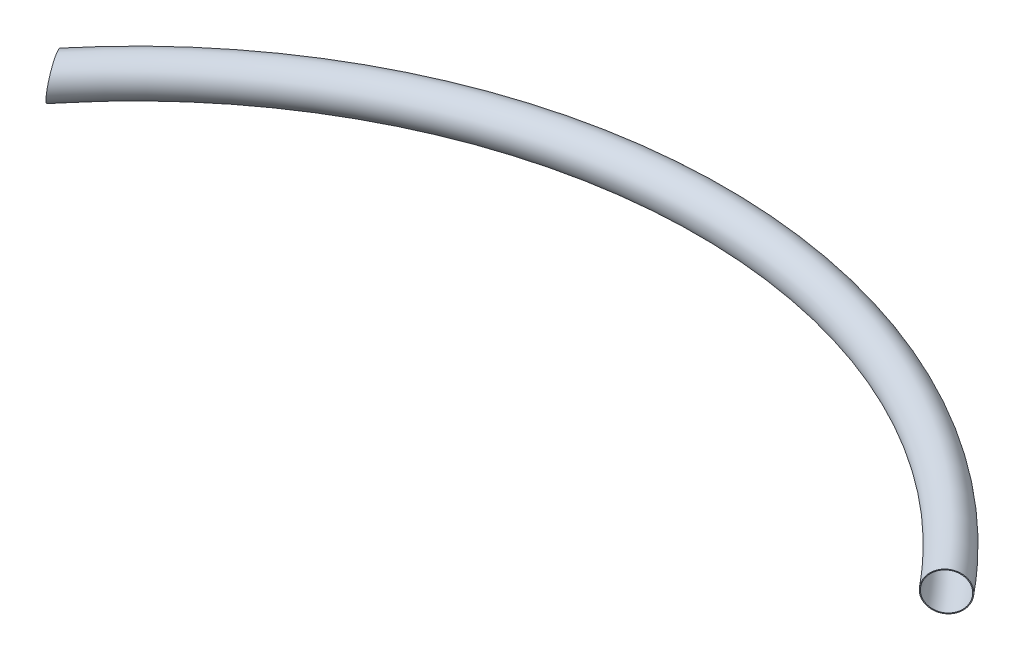
ISO-10303-21;
HEADER;
FILE_DESCRIPTION(('STEP AP214'),'2;1');
FILE_NAME('part.step','',(''),(''),'','','');
FILE_SCHEMA(('AUTOMOTIVE_DESIGN { 1 0 10303 214 1 1 1 1 }'));
ENDSEC;
DATA;
#1=APPLICATION_CONTEXT('core data for automotive mechanical design processes');
#2=APPLICATION_PROTOCOL_DEFINITION('international standard','automotive_design',2000,#1);
#3=PRODUCT_CONTEXT('',#1,'mechanical');
#4=PRODUCT('Part','Part','',(#3));
#5=PRODUCT_RELATED_PRODUCT_CATEGORY('part','',(#4));
#6=PRODUCT_DEFINITION_FORMATION('','',#4);
#7=PRODUCT_DEFINITION_CONTEXT('part definition',#1,'design');
#8=PRODUCT_DEFINITION('design','',#6,#7);
#9=PRODUCT_DEFINITION_SHAPE('','',#8);
#10=(LENGTH_UNIT() NAMED_UNIT(*) SI_UNIT(.MILLI.,.METRE.));
#11=(NAMED_UNIT(*) PLANE_ANGLE_UNIT() SI_UNIT($,.RADIAN.));
#12=(NAMED_UNIT(*) SI_UNIT($,.STERADIAN.) SOLID_ANGLE_UNIT());
#13=UNCERTAINTY_MEASURE_WITH_UNIT(LENGTH_MEASURE(1.E-05),#10,'distance_accuracy_value','');
#14=(GEOMETRIC_REPRESENTATION_CONTEXT(3) GLOBAL_UNCERTAINTY_ASSIGNED_CONTEXT((#13)) GLOBAL_UNIT_ASSIGNED_CONTEXT((#10,
#11,#12)) REPRESENTATION_CONTEXT('',''));
#15=CARTESIAN_POINT('',(0.,0.,0.));
#16=DIRECTION('',(0.,0.,1.));
#17=DIRECTION('',(1.,0.,0.));
#18=AXIS2_PLACEMENT_3D('',#15,#16,#17);
#19=CARTESIAN_POINT('',(0.,0.,1141.91160740362));
#20=DIRECTION('',(0.,-1.,0.));
#21=DIRECTION('',(0.,0.,-1.));
#22=AXIS2_PLACEMENT_3D('',#19,#20,#21);
#23=TOROIDAL_SURFACE('',#22,2500.81160740362,80.7338999999999);
#24=CARTESIAN_POINT('',(-1979.20686929793,-35.3852383598706,-502.780856281421));
#25=CARTESIAN_POINT('',(-1979.3991245248,-34.4097320346065,-503.293783131036));
#26=CARTESIAN_POINT('',(-1979.58008716303,-33.4234639280079,-503.790337505917));
#27=CARTESIAN_POINT('',(-1979.91897412592,-31.4308692296872,-504.749660949201));
#28=CARTESIAN_POINT('',(-1980.07690156036,-30.4245453663966,-505.212434573812));
#29=CARTESIAN_POINT('',(-1980.36933264064,-28.3931034040863,-506.103307878676));
#30=CARTESIAN_POINT('',(-1980.50383206896,-27.3679819577444,-506.531401308362));
#31=CARTESIAN_POINT('',(-1980.74898213253,-25.3006826151861,-507.351864955006));
#32=CARTESIAN_POINT('',(-1980.85963191885,-24.258504113247,-507.744233900069));
#33=CARTESIAN_POINT('',(-1981.05676831842,-22.1582614653444,-508.492495595245));
#34=CARTESIAN_POINT('',(-1981.14324238078,-21.100189367417,-508.848369338326));
#35=CARTESIAN_POINT('',(-1981.29164037947,-18.9703377150807,-509.522564850368));
#36=CARTESIAN_POINT('',(-1981.35356212045,-17.8985569437548,-509.840883259542));
#37=CARTESIAN_POINT('',(-1981.4525659267,-15.7433195508101,-510.439081929846));
#38=CARTESIAN_POINT('',(-1981.48965094582,-14.6598643332236,-510.718966758772));
#39=CARTESIAN_POINT('',(-1981.53877120841,-12.4829229907933,-511.239620734417));
#40=CARTESIAN_POINT('',(-1981.55080413865,-11.3894359490103,-511.480386267112));
#41=CARTESIAN_POINT('',(-1981.54963958368,-9.19268637284358,-511.922453337221));
#42=CARTESIAN_POINT('',(-1981.53640135289,-8.08941091123625,-512.123690564743));
#43=CARTESIAN_POINT('',(-1981.48449256695,-5.87671522718254,-512.485635600725));
#44=CARTESIAN_POINT('',(-1981.4458195946,-4.76729443064848,-512.646339555076));
#45=CARTESIAN_POINT('',(-1981.34298157329,-2.54453611819855,-512.92666960051));
#46=CARTESIAN_POINT('',(-1981.27881851067,-1.43119891417171,-513.046298891027));
#47=CARTESIAN_POINT('',(-1981.12499158504,0.797507777516382,-513.2440844216));
#48=CARTESIAN_POINT('',(-1981.03532525997,1.91287745105507,-513.322236655431));
#49=CARTESIAN_POINT('',(-1980.83058715901,4.14307701744492,-513.436704845798));
#50=CARTESIAN_POINT('',(-1980.715523482,5.25790696908307,-513.473034116209));
#51=CARTESIAN_POINT('',(-1980.46008741844,7.48535285808889,-513.503676897148));
#52=CARTESIAN_POINT('',(-1980.31971249135,8.59796856186193,-513.497986187721));
#53=CARTESIAN_POINT('',(-1980.01386331799,10.8186100605355,-513.444452735829));
#54=CARTESIAN_POINT('',(-1979.84839218149,11.9266364066669,-513.396615212387));
#55=CARTESIAN_POINT('',(-1979.49259951448,14.136086708019,-513.258790241673));
#56=CARTESIAN_POINT('',(-1979.30227564159,15.2375100306536,-513.168798819299));
#57=CARTESIAN_POINT('',(-1978.70717079521,18.4598326055181,-512.842624740277));
#58=CARTESIAN_POINT('',(-1978.26853304244,20.5690309131438,-512.548469165553));
#59=CARTESIAN_POINT('',(-1977.30217837921,24.7385461549989,-511.803970653447));
#60=CARTESIAN_POINT('',(-1976.77446332982,26.7988641094489,-511.353630978977));
#61=CARTESIAN_POINT('',(-1975.63384164525,30.8557352386496,-510.300141360386));
#62=CARTESIAN_POINT('',(-1975.02094243889,32.8522939551197,-509.697004737744));
#63=CARTESIAN_POINT('',(-1973.71464122692,36.7673088691517,-508.342724554317));
#64=CARTESIAN_POINT('',(-1973.02123946605,38.685765304125,-507.591581443474));
#65=CARTESIAN_POINT('',(-1971.57000943179,42.4038122410931,-505.959454185326));
#66=CARTESIAN_POINT('',(-1970.81326552163,44.2047262215228,-505.080518535497));
#67=CARTESIAN_POINT('',(-1969.23265760134,47.7057112443548,-503.192024700909));
#68=CARTESIAN_POINT('',(-1968.40879458239,49.4057837752954,-502.182468444964));
#69=CARTESIAN_POINT('',(-1966.70014661937,52.6944525477765,-500.040764509439));
#70=CARTESIAN_POINT('',(-1965.81536007325,54.2830458556495,-498.908613605673));
#71=CARTESIAN_POINT('',(-1963.99143946698,57.3392969371135,-496.530606730909));
#72=CARTESIAN_POINT('',(-1963.05230429106,58.8069522263533,-495.284748425202));
#73=CARTESIAN_POINT('',(-1961.10499502209,61.6444780953998,-492.659875808818));
#74=CARTESIAN_POINT('',(-1960.09574843969,63.0114385623153,-491.278511832024));
#75=CARTESIAN_POINT('',(-1958.03493708867,65.6031536085334,-488.417537480918));
#76=CARTESIAN_POINT('',(-1956.98337192124,66.8279068472306,-486.937926180623));
#77=CARTESIAN_POINT('',(-1954.84517020738,69.1294613242307,-483.891198368159));
#78=CARTESIAN_POINT('',(-1953.7585288182,70.2062420240798,-482.324069751034));
#79=CARTESIAN_POINT('',(-1951.55763331375,72.2070590909239,-479.113589202808));
#80=CARTESIAN_POINT('',(-1950.44337839745,73.1310910208972,-477.470235059294));
#81=CARTESIAN_POINT('',(-1948.13815927148,74.8653294362464,-474.034530603023));
#82=CARTESIAN_POINT('',(-1946.94614646326,75.6675272768953,-472.238839411558));
#83=CARTESIAN_POINT('',(-1944.547731136,77.0970553839469,-468.588480581178));
#84=CARTESIAN_POINT('',(-1943.34132820753,77.7243806624434,-466.733811261704));
#85=CARTESIAN_POINT('',(-1940.92175009196,78.802782977862,-462.977728416542));
#86=CARTESIAN_POINT('',(-1939.70857358884,79.2538244642697,-461.076305544326));
#87=CARTESIAN_POINT('',(-1937.28325281461,79.9790415127317,-457.239409241176));
#88=CARTESIAN_POINT('',(-1936.07110857424,80.253211979053,-455.303934830851));
#89=CARTESIAN_POINT('',(-1933.5832744689,80.6361808602752,-451.295192547975));
#90=CARTESIAN_POINT('',(-1932.30809119031,80.7341781945253,-449.220573737698));
#91=CARTESIAN_POINT('',(-1929.77538238225,80.7336205870288,-445.060613378186));
#92=CARTESIAN_POINT('',(-1928.51785750743,80.6350583775755,-442.975271435312));
#93=CARTESIAN_POINT('',(-1926.02822139539,80.2436950901279,-438.807071027152));
#94=CARTESIAN_POINT('',(-1924.7961155865,79.9508529568476,-436.724213180025));
#95=CARTESIAN_POINT('',(-1922.36530580337,79.1740204650871,-432.57472582036));
#96=CARTESIAN_POINT('',(-1921.16660249877,78.6900262774274,-430.508096633761));
#97=CARTESIAN_POINT('',(-1918.75570341682,77.5080443416732,-426.309427822483));
#98=CARTESIAN_POINT('',(-1917.54543333223,76.8012197314871,-424.178765054919));
#99=CARTESIAN_POINT('',(-1915.17790837901,75.1876982227604,-419.964118653642));
#100=CARTESIAN_POINT('',(-1914.02065529094,74.2809946172786,-417.880136588884));
#101=CARTESIAN_POINT('',(-1911.767103255,72.2735066983154,-413.773061401992));
#102=CARTESIAN_POINT('',(-1910.67081324538,71.172694023188,-411.749977228405));
#103=CARTESIAN_POINT('',(-1908.54734944141,68.7839606221137,-407.779512851352));
#104=CARTESIAN_POINT('',(-1907.52017550308,67.4960402859468,-405.832132490193));
#105=CARTESIAN_POINT('',(-1905.53111871811,64.724547534705,-402.005066350618));
#106=CARTESIAN_POINT('',(-1904.57012747232,63.238886290534,-400.126422813802));
#107=CARTESIAN_POINT('',(-1903.19377060545,60.8798779421932,-397.389051908668));
#108=CARTESIAN_POINT('',(-1902.74577686396,60.0716563517338,-396.489896844471));
#109=CARTESIAN_POINT('',(-1901.87240942962,58.4128565547507,-394.720178421511));
#110=CARTESIAN_POINT('',(-1901.44703342148,57.5622827009974,-393.849612139725));
#111=CARTESIAN_POINT('',(-1900.61983190796,55.8200388420599,-392.138854255442));
#112=CARTESIAN_POINT('',(-1900.21800783735,54.9283663390361,-391.298664504683));
#113=CARTESIAN_POINT('',(-1899.43891397681,53.1054675284857,-389.650620057562));
#114=CARTESIAN_POINT('',(-1899.0616416026,52.1742454009921,-388.842761961484));
#115=CARTESIAN_POINT('',(-1898.33250971175,50.2735987282998,-387.261064118955));
#116=CARTESIAN_POINT('',(-1897.98065220301,49.3041711740293,-386.487227062207));
#117=CARTESIAN_POINT('',(-1897.30333029898,47.3288984382168,-384.97554203937));
#118=CARTESIAN_POINT('',(-1896.97786293388,46.3230573729528,-384.237690027435));
#119=CARTESIAN_POINT('',(-1896.36427755386,44.3097517455021,-382.82300232389));
#120=CARTESIAN_POINT('',(-1896.07529082022,43.3033967550287,-382.144964058068));
#121=CARTESIAN_POINT('',(-1895.52362731844,41.2598693025282,-380.825871884782));
#122=CARTESIAN_POINT('',(-1895.26094760298,40.2227003096928,-380.184813837629));
#123=CARTESIAN_POINT('',(-1894.76258654337,38.119080354742,-378.941123110482));
#124=CARTESIAN_POINT('',(-1894.52690813079,37.0526262286417,-378.338494605994));
#125=CARTESIAN_POINT('',(-1894.0833247529,34.8925213135489,-377.17335744398));
#126=CARTESIAN_POINT('',(-1893.87541678151,33.7988734834169,-376.610844447153));
#127=CARTESIAN_POINT('',(-1893.48806051126,31.5864488498346,-375.527483286934));
#128=CARTESIAN_POINT('',(-1893.30860686449,30.4676768136247,-375.006627303391));
#129=CARTESIAN_POINT('',(-1892.97876517007,28.2070086670862,-374.007980579284));
#130=CARTESIAN_POINT('',(-1892.82837395298,27.065115093331,-373.530185145729));
#131=CARTESIAN_POINT('',(-1892.55721619487,24.7602715033136,-372.61899566165));
#132=CARTESIAN_POINT('',(-1892.43644989559,23.5973213153169,-372.185601973452));
#133=CARTESIAN_POINT('',(-1892.22507230736,21.2526888629364,-371.364556799671));
#134=CARTESIAN_POINT('',(-1892.13446055547,20.0710068864205,-370.97690461191));
#135=CARTESIAN_POINT('',(-1891.988678112,17.7675641181712,-370.271920934093));
#136=CARTESIAN_POINT('',(-1891.93160887285,16.646814159375,-369.951675471567));
#137=CARTESIAN_POINT('',(-1891.84460821734,14.3929847492145,-369.353265180202));
#138=CARTESIAN_POINT('',(-1891.8146789817,13.2599043144857,-369.075103734352));
#139=CARTESIAN_POINT('',(-1891.78223269777,10.9837348268435,-368.561781172809));
#140=CARTESIAN_POINT('',(-1891.77971373032,9.84064648025679,-368.326617047732));
#141=CARTESIAN_POINT('',(-1891.80228340571,7.54660657875503,-367.900043703805));
#142=CARTESIAN_POINT('',(-1891.82737187913,6.3956550721418,-367.708634216427));
#143=CARTESIAN_POINT('',(-1891.90527696413,4.08850408874175,-367.370296668432));
#144=CARTESIAN_POINT('',(-1891.9580854991,2.93230623777458,-367.223355670958));
#145=CARTESIAN_POINT('',(-1892.0914787363,0.616787702436909,-366.974463494447));
#146=CARTESIAN_POINT('',(-1892.17206064849,-0.542532656651809,-366.872507798646));
#147=CARTESIAN_POINT('',(-1892.3609862143,-2.86203597223574,-366.714019342639));
#148=CARTESIAN_POINT('',(-1892.4693302846,-4.02221894141743,-366.65748726426));
#149=CARTESIAN_POINT('',(-1892.71368341229,-6.34099103230734,-366.590183595107));
#150=CARTESIAN_POINT('',(-1892.84969208349,-7.49958017603699,-366.579411365604));
#151=CARTESIAN_POINT('',(-1893.13980422272,-9.74017626812419,-366.603064550224));
#152=CARTESIAN_POINT('',(-1893.29223838423,-10.8224300270853,-366.634698329509));
#153=CARTESIAN_POINT('',(-1893.62105748527,-12.981448510955,-366.738413219747));
#154=CARTESIAN_POINT('',(-1893.79744446845,-14.0582127593602,-366.810497783581));
#155=CARTESIAN_POINT('',(-1894.1738571996,-16.2039673751842,-366.995063561691));
#156=CARTESIAN_POINT('',(-1894.3738797116,-17.2729587855654,-367.107539250267));
#157=CARTESIAN_POINT('',(-1894.79726430162,-19.401392672971,-367.372754610397));
#158=CARTESIAN_POINT('',(-1895.0206286545,-20.4608342083252,-367.52549820863));
#159=CARTESIAN_POINT('',(-1895.49021311669,-22.5677563295881,-367.870942241803));
#160=CARTESIAN_POINT('',(-1895.73642684442,-23.6152401639136,-368.063631538802));
#161=CARTESIAN_POINT('',(-1896.25132559811,-25.6966689032516,-368.488654437833));
#162=CARTESIAN_POINT('',(-1896.5200128768,-26.730612438944,-368.720992016634));
#163=CARTESIAN_POINT('',(-1897.07928555813,-28.7827984087923,-369.224807060611));
#164=CARTESIAN_POINT('',(-1897.36986864314,-29.8010424909919,-369.496280386133));
#165=CARTESIAN_POINT('',(-1897.97240897862,-31.8201400587458,-370.077847807732));
#166=CARTESIAN_POINT('',(-1898.28436823432,-32.8209919017264,-370.387945529264));
#167=CARTESIAN_POINT('',(-1898.91970585018,-34.7747646983948,-371.036583478037));
#168=CARTESIAN_POINT('',(-1899.24249526736,-35.7282354763953,-371.374045272173));
#169=CARTESIAN_POINT('',(-1899.90702097686,-37.6153955537379,-372.084086143378));
#170=CARTESIAN_POINT('',(-1900.24875898371,-38.5490830524207,-372.456668400412));
#171=CARTESIAN_POINT('',(-1900.95045952312,-40.3949220879161,-373.236118368949));
#172=CARTESIAN_POINT('',(-1901.31041984548,-41.3070762169387,-373.642981926411));
#173=CARTESIAN_POINT('',(-1902.0479041242,-43.1084821659628,-374.490185163368));
#174=CARTESIAN_POINT('',(-1902.42542970494,-43.9977318559703,-374.930527941316));
#175=CARTESIAN_POINT('',(-1903.58321019777,-46.6287743507846,-376.300370854118));
#176=CARTESIAN_POINT('',(-1904.38885074788,-48.3343386360893,-377.278887690211));
#177=CARTESIAN_POINT('',(-1906.06122218913,-51.6372039445149,-379.358140023528));
#178=CARTESIAN_POINT('',(-1906.9279543328,-53.2345027466373,-380.458878026822));
#179=CARTESIAN_POINT('',(-1908.73101837575,-56.3374965250335,-382.793181984022));
#180=CARTESIAN_POINT('',(-1909.66826786064,-57.8412269450002,-384.028652078185));
#181=CARTESIAN_POINT('',(-1911.59227189124,-60.7191531266928,-386.607081794681));
#182=CARTESIAN_POINT('',(-1912.57902667865,-62.0933482559313,-387.950041941801));
#183=CARTESIAN_POINT('',(-1914.59509278732,-64.705475490302,-390.733399009756));
#184=CARTESIAN_POINT('',(-1915.62441004461,-65.9433884999332,-392.173809539552));
#185=CARTESIAN_POINT('',(-1917.71838962146,-68.2771004154219,-395.141405438825));
#186=CARTESIAN_POINT('',(-1918.78305303397,-69.3728949216278,-396.668593492624));
#187=CARTESIAN_POINT('',(-1920.99605488155,-71.4703446480974,-399.879427909192));
#188=CARTESIAN_POINT('',(-1922.14588495556,-72.4642946170999,-401.567081504281));
#189=CARTESIAN_POINT('',(-1924.4688987967,-74.2863091605275,-405.014272668116));
#190=CARTESIAN_POINT('',(-1925.6420832338,-75.1143689685287,-406.773812300572));
#191=CARTESIAN_POINT('',(-1928.0043086435,-76.6020583027345,-410.352976173424));
#192=CARTESIAN_POINT('',(-1929.19335291969,-77.261652142358,-412.172613052336));
#193=CARTESIAN_POINT('',(-1931.57957099481,-78.4105334577448,-415.859659356187));
#194=CARTESIAN_POINT('',(-1932.77674503969,-78.8998157574237,-417.727070231217));
#195=CARTESIAN_POINT('',(-1935.24773954448,-79.7328325930582,-421.617196197888));
#196=CARTESIAN_POINT('',(-1936.52162121262,-80.0654112984727,-423.642266499163));
#197=CARTESIAN_POINT('',(-1939.06201166785,-80.5372204949395,-427.719374657352));
#198=CARTESIAN_POINT('',(-1940.32852016515,-80.6764434366871,-429.77141356406));
#199=CARTESIAN_POINT('',(-1942.84627640487,-80.7624864415937,-433.889312434943));
#200=CARTESIAN_POINT('',(-1944.09752137258,-80.7092720301052,-435.955174809383));
#201=CARTESIAN_POINT('',(-1946.57670524519,-80.412088640569,-440.087173463052));
#202=CARTESIAN_POINT('',(-1947.80464367754,-80.1681157990095,-442.15330974698));
#203=CARTESIAN_POINT('',(-1950.28953898218,-79.4751596662172,-446.374677823235));
#204=CARTESIAN_POINT('',(-1951.54493050964,-79.0166398439304,-448.529266020334));
#205=CARTESIAN_POINT('',(-1954.01329740804,-77.8957187639052,-452.809981985326));
#206=CARTESIAN_POINT('',(-1955.22627114525,-77.2333096629451,-454.936108655074));
#207=CARTESIAN_POINT('',(-1957.00747426798,-76.0903017880499,-458.092656363928));
#208=CARTESIAN_POINT('',(-1957.59501605979,-75.6842447472827,-459.139731614283));
#209=CARTESIAN_POINT('',(-1958.75631326806,-74.8229397773315,-461.221180534931));
#210=CARTESIAN_POINT('',(-1959.33006993526,-74.3676963317047,-462.255555353368));
#211=CARTESIAN_POINT('',(-1960.46282824634,-73.4086699017893,-464.309880811555));
#212=CARTESIAN_POINT('',(-1961.02182871085,-72.9048830526633,-465.32983029539));
#213=CARTESIAN_POINT('',(-1962.12398089256,-71.8495968480079,-467.353341547854));
#214=CARTESIAN_POINT('',(-1962.66713405918,-71.2981018743759,-468.356904811481));
#215=CARTESIAN_POINT('',(-1963.74525501288,-70.1389147113156,-470.361945146491));
#216=CARTESIAN_POINT('',(-1964.279950203,-69.5304606673519,-471.363128467571));
#217=CARTESIAN_POINT('',(-1965.33090976126,-68.2660724248425,-473.344819505891));
#218=CARTESIAN_POINT('',(-1965.84717587541,-67.610142742136,-474.325329178162));
#219=CARTESIAN_POINT('',(-1966.86039506002,-66.2516205254088,-476.264058730539));
#220=CARTESIAN_POINT('',(-1967.35734461989,-65.5490195716452,-477.222274546385));
#221=CARTESIAN_POINT('',(-1968.33076523102,-64.098402375491,-479.114250026108));
#222=CARTESIAN_POINT('',(-1968.80723834263,-63.3503907207314,-480.048012146831));
#223=CARTESIAN_POINT('',(-1969.73829261827,-61.8107982163294,-481.888385623848));
#224=CARTESIAN_POINT('',(-1970.19289501851,-61.0192612982221,-482.795022980671));
#225=CARTESIAN_POINT('',(-1971.07967786072,-59.3932557825328,-484.580147567102));
#226=CARTESIAN_POINT('',(-1971.51186053731,-58.5587914802006,-485.458637598871));
#227=CARTESIAN_POINT('',(-1972.35280656927,-56.8483186526513,-487.185549000865));
#228=CARTESIAN_POINT('',(-1972.76157425666,-55.9723178672944,-488.033975921932));
#229=CARTESIAN_POINT('',(-1973.55478177764,-54.1801436681172,-489.698991673488));
#230=CARTESIAN_POINT('',(-1973.93922291366,-53.2639724094634,-490.515582207586));
#231=CARTESIAN_POINT('',(-1974.81937574526,-51.0494156313781,-492.40876801837));
#232=CARTESIAN_POINT('',(-1975.3041594069,-49.7341290708431,-493.470830374279));
#233=CARTESIAN_POINT('',(-1975.99410279998,-47.7104219173547,-495.013034526311));
#234=CARTESIAN_POINT('',(-1976.21786273529,-47.0274446945231,-495.518583929317));
#235=CARTESIAN_POINT('',(-1976.65278508178,-45.6448897641293,-496.512347015614));
#236=CARTESIAN_POINT('',(-1976.86394560391,-44.9453095891297,-497.000558094924));
#237=CARTESIAN_POINT('',(-1977.47801500378,-42.8228191054169,-498.438107866587));
#238=CARTESIAN_POINT('',(-1977.86159980472,-41.3759006505432,-499.36055995727));
#239=CARTESIAN_POINT('',(-1978.57503479884,-38.4232531185606,-501.129093804354));
#240=CARTESIAN_POINT('',(-1978.90488302623,-36.9175218924635,-501.975172766374));
#241=CARTESIAN_POINT('',(-1979.20686929793,-35.3852383598706,-502.780856281421));
#242=B_SPLINE_CURVE_WITH_KNOTS('',3,(#24,#25,#26,#27,#28,#29,#30,#31,#32,#33,#34,#35,#36,#37,
#38,#39,#40,#41,#42,#43,#44,#45,#46,#47,#48,#49,#50,#51,#52,#53,#54,#55,#56,#57,#58,#59,#60,#61,
#62,#63,#64,#65,#66,#67,#68,#69,#70,#71,#72,#73,#74,#75,#76,#77,#78,#79,#80,#81,#82,#83,#84,#85,
#86,#87,#88,#89,#90,#91,#92,#93,#94,#95,#96,#97,#98,#99,#100,#101,#102,#103,#104,#105,#106,#107,
#108,#109,#110,#111,#112,#113,#114,#115,#116,#117,#118,#119,#120,#121,#122,#123,#124,#125,#126,
#127,#128,#129,#130,#131,#132,#133,#134,#135,#136,#137,#138,#139,#140,#141,#142,#143,#144,#145,
#146,#147,#148,#149,#150,#151,#152,#153,#154,#155,#156,#157,#158,#159,#160,#161,#162,#163,#164,
#165,#166,#167,#168,#169,#170,#171,#172,#173,#174,#175,#176,#177,#178,#179,#180,#181,#182,#183,
#184,#185,#186,#187,#188,#189,#190,#191,#192,#193,#194,#195,#196,#197,#198,#199,#200,#201,#202,
#203,#204,#205,#206,#207,#208,#209,#210,#211,#212,#213,#214,#215,#216,#217,#218,#219,#220,#221,
#222,#223,#224,#225,#226,#227,#228,#229,#230,#231,#232,#233,#234,#235,#236,#237,#238,#239,#240,
#241),.UNSPECIFIED.,.T.,.F.,(4,2,2,2,2,2,2,2,2,2,2,2,2,2,2,2,2,2,2,2,2,2,2,2,2,2,2,2,2,2,2,2,2,
2,2,2,2,2,2,2,2,2,2,2,2,2,2,2,2,2,2,2,2,2,2,2,2,2,2,2,2,2,2,2,2,2,2,2,2,2,2,2,2,2,2,2,2,2,2,2,2,
2,2,2,2,2,2,2,2,2,2,2,2,2,2,2,2,2,2,2,2,2,2,2,2,2,2,2,4),(0.,3.35599820151084,6.7115429203625,
10.0676910847131,13.4239586908442,16.7819654877918,20.1402724724121,23.4981799793417,
26.856397529313,30.2200342251254,33.5839906321782,36.9476849506978,40.3117041058627,
43.67465206651,47.037937763616,50.4008070449816,53.7639935078934,60.2782743286442,
66.7924190648425,73.305996065875,79.819553265775,86.2383256914214,92.6570033448485,
99.075849847772,105.49482817604,112.05693649182,118.619106664397,125.182186742247,
131.745457429901,138.637123706034,145.528986533692,152.422238502123,159.315689059349,
166.618980003533,173.922540988845,181.227645856458,188.532897068181,196.17493538131,
203.817230162137,211.460642499879,219.104038915207,226.835756153953,230.702790108578,
234.569427444313,238.436300092121,242.302765059042,246.169535160968,250.03586950974,
253.776872208512,257.517455311077,261.258444151169,264.999027712115,268.738907407805,
272.47837901533,276.217881135164,279.957325842385,283.457216199552,286.957387751479,
290.457314232411,293.957219233283,297.456105054131,300.954639488122,304.453226435512,
307.951764548407,311.230937033447,314.510389471367,317.789393435279,321.068717265796,
324.347127958937,327.62586767402,330.904260828636,334.182961939726,337.367089117345,
340.551504877564,343.735535319199,346.919860797849,353.286866925317,359.654003628417,
366.127001207477,372.600030390875,379.073965407237,385.548100793452,392.354112130252,
399.160318992106,405.967966436772,412.775820760445,420.01402670011,427.252515237435,
434.492300595243,441.732232587307,449.329993171486,456.92804606318,460.729530070552,
464.530667847819,468.332108507385,472.133200382074,475.995493037248,479.857418796278,
483.720043169213,487.582277966534,491.44068358704,495.298703889335,499.156008096296,
503.013105609523,508.285404356072,510.921146589805,513.557283016426,518.828548387786,
524.100006548957),.UNSPECIFIED.);
#243=CARTESIAN_POINT('',(-1979.20686929793,-35.3852383598706,-502.780856281421));
#244=VERTEX_POINT('',#243);
#245=EDGE_CURVE('E49',#244,#244,#242,.T.);
#246=ORIENTED_EDGE('',*,*,#245,.F.);
#247=EDGE_LOOP('',(#246));
#248=FACE_BOUND('',#247,.T.);
#249=CARTESIAN_POINT('',(1936.74818533626,0.,-440.196215192991));
#250=DIRECTION('',(-0.632637747646725,0.,-0.77444785508934));
#251=DIRECTION('',(-0.77444785508934,0.,0.632637747646725));
#252=AXIS2_PLACEMENT_3D('',#249,#250,#251);
#253=CIRCLE('',#252,80.7338999999999);
#254=CARTESIAN_POINT('',(1874.22398964826,0.,-389.120902538255));
#255=VERTEX_POINT('',#254);
#256=EDGE_CURVE('E53',#255,#255,#253,.T.);
#257=ORIENTED_EDGE('',*,*,#256,.F.);
#258=EDGE_LOOP('',(#257));
#259=FACE_BOUND('',#258,.T.);
#260=ADVANCED_FACE('F38',(#248,#259),#23,.F.);
#261=CARTESIAN_POINT('',(559.47382164096,0.,684.883731266744));
#262=DIRECTION('',(-0.632637747646725,0.,-0.77444785508934));
#263=DIRECTION('',(-0.77444785508934,0.,0.632637747646725));
#264=AXIS2_PLACEMENT_3D('',#261,#262,#263);
#265=PLANE('',#264);
#266=ORIENTED_EDGE('',*,*,#256,.T.);
#267=EDGE_LOOP('',(#266));
#268=FACE_BOUND('',#267,.T.);
#269=CARTESIAN_POINT('',(1936.74818533626,0.,-440.196215192991));
#270=DIRECTION('',(-0.632637747646725,0.,-0.77444785508934));
#271=DIRECTION('',(-0.77444785508934,0.,0.632637747646725));
#272=AXIS2_PLACEMENT_3D('',#269,#270,#271);
#273=CIRCLE('',#272,84.1374999999999);
#274=CARTESIAN_POINT('',(1871.58807892868,0.,-386.967656700365));
#275=VERTEX_POINT('',#274);
#276=EDGE_CURVE('E58',#275,#275,#273,.T.);
#277=ORIENTED_EDGE('',*,*,#276,.F.);
#278=EDGE_LOOP('',(#277));
#279=FACE_BOUND('',#278,.T.);
#280=ADVANCED_FACE('F67',(#268,#279),#265,.F.);
#281=CARTESIAN_POINT('',(0.,0.,1141.91160740362));
#282=DIRECTION('',(0.,-1.,0.));
#283=DIRECTION('',(0.,0.,-1.));
#284=AXIS2_PLACEMENT_3D('',#281,#282,#283);
#285=TOROIDAL_SURFACE('',#284,2500.81160740362,84.1374999999999);
#286=CARTESIAN_POINT('',(-1980.7480870676,-38.0946259409135,-504.764641624163));
#287=CARTESIAN_POINT('',(-1980.9583149747,-37.0845888247402,-505.314066638411));
#288=CARTESIAN_POINT('',(-1981.15681522281,-36.0629811665172,-505.846568053307));
#289=CARTESIAN_POINT('',(-1981.52987251687,-33.9981352438934,-506.876617079955));
#290=CARTESIAN_POINT('',(-1981.70443278929,-32.9548999161742,-507.374169397477));
#291=CARTESIAN_POINT('',(-1982.02919459607,-30.8481015528841,-508.333374406735));
#292=CARTESIAN_POINT('',(-1982.17939173785,-29.7845348902166,-508.795020616963));
#293=CARTESIAN_POINT('',(-1982.45496546536,-27.6388690179536,-509.68129208297));
#294=CARTESIAN_POINT('',(-1982.58034116888,-26.5567691511437,-510.105916022618));
#295=CARTESIAN_POINT('',(-1982.80593116805,-24.3752409337618,-510.917339765066));
#296=CARTESIAN_POINT('',(-1982.9061323103,-23.2758038421974,-511.30411973069));
#297=CARTESIAN_POINT('',(-1983.08094573058,-21.0618593834994,-512.038697048377));
#298=CARTESIAN_POINT('',(-1983.15555572151,-19.9473506786525,-512.386490914356));
#299=CARTESIAN_POINT('',(-1983.27886275334,-17.7053683018973,-513.042138239132));
#300=CARTESIAN_POINT('',(-1983.32756287501,-16.5778961876758,-513.349996443119));
#301=CARTESIAN_POINT('',(-1983.39881230069,-14.3116925421488,-513.925037053603));
#302=CARTESIAN_POINT('',(-1983.4213591902,-13.1729599810516,-514.192215702538));
#303=CARTESIAN_POINT('',(-1983.44010764792,-10.8844520206058,-514.685533968172));
#304=CARTESIAN_POINT('',(-1983.43626565382,-9.73466149218562,-514.911605093647));
#305=CARTESIAN_POINT('',(-1983.40198569375,-7.42785558063671,-515.321524987839));
#306=CARTESIAN_POINT('',(-1983.37154519925,-6.27083952100893,-515.505369740288));
#307=CARTESIAN_POINT('',(-1983.28398125152,-3.95190245457163,-515.830225145894));
#308=CARTESIAN_POINT('',(-1983.22685986859,-2.78998183525966,-515.971239121081));
#309=CARTESIAN_POINT('',(-1983.08590328033,-0.463200281571591,-516.209985213062));
#310=CARTESIAN_POINT('',(-1983.0020654943,0.701660926065804,-516.307713146405));
#311=CARTESIAN_POINT('',(-1982.80774392345,3.03168986444723,-516.459466242152));
#312=CARTESIAN_POINT('',(-1982.69726739502,4.1968574255482,-516.513503288549));
#313=CARTESIAN_POINT('',(-1982.44976222194,6.52558512507905,-516.577641984851));
#314=CARTESIAN_POINT('',(-1982.31273354239,7.68914526139481,-516.587743577025));
#315=CARTESIAN_POINT('',(-1982.01230226694,10.0123699430484,-516.563841593038));
#316=CARTESIAN_POINT('',(-1981.8489004071,11.1720345961858,-516.529839247613));
#317=CARTESIAN_POINT('',(-1981.49596183552,13.4852394008656,-516.417671560102));
#318=CARTESIAN_POINT('',(-1981.30642512212,14.6387795520159,-516.339506215188));
#319=CARTESIAN_POINT('',(-1980.90803171202,16.9005471557699,-516.14228537726));
#320=CARTESIAN_POINT('',(-1980.6999909454,18.0090401083173,-516.024623668169));
#321=CARTESIAN_POINT('',(-1980.26004472095,20.2162082910844,-515.748119450834));
#322=CARTESIAN_POINT('',(-1980.02813721186,21.3148826685909,-515.589273401128));
#323=CARTESIAN_POINT('',(-1979.54089459399,23.5001844219729,-515.230667849249));
#324=CARTESIAN_POINT('',(-1979.28556210474,24.586813129669,-515.030912918669));
#325=CARTESIAN_POINT('',(-1978.75191408556,26.7461553118932,-514.590842187204));
#326=CARTESIAN_POINT('',(-1978.47359634945,27.8188674392013,-514.350522490461));
#327=CARTESIAN_POINT('',(-1977.60501658499,31.0127316560659,-513.569427872959));
#328=CARTESIAN_POINT('',(-1976.98094613488,33.110427006248,-512.968383523395));
#329=CARTESIAN_POINT('',(-1975.64775659383,37.22653123599,-511.61058228279));
#330=CARTESIAN_POINT('',(-1974.9386378697,39.2449404574627,-510.853826063327));
#331=CARTESIAN_POINT('',(-1973.45297825977,43.1565095327622,-509.204262243217));
#332=CARTESIAN_POINT('',(-1972.67771757725,45.0511699475706,-508.313860587268));
#333=CARTESIAN_POINT('',(-1971.05612382025,48.737547595244,-506.395518823073));
#334=CARTESIAN_POINT('',(-1970.20979187354,50.5292664608518,-505.367580897135));
#335=CARTESIAN_POINT('',(-1968.4524339453,53.9984609146227,-503.182358890593));
#336=CARTESIAN_POINT('',(-1967.54140667491,55.6759342254954,-502.025072232858));
#337=CARTESIAN_POINT('',(-1965.66144871266,58.9065363341078,-499.590264469329));
#338=CARTESIAN_POINT('',(-1964.69251687363,60.4596626669229,-498.312740981177));
#339=CARTESIAN_POINT('',(-1962.68328060856,63.4634870254525,-495.619766557317));
#340=CARTESIAN_POINT('',(-1961.64191657362,64.9114132457373,-494.202015063997));
#341=CARTESIAN_POINT('',(-1959.5138484834,67.6607942921557,-491.262440376973));
#342=CARTESIAN_POINT('',(-1958.42714405222,68.9622479035985,-489.740616320367));
#343=CARTESIAN_POINT('',(-1956.215918443,71.4124664212245,-486.603996541679));
#344=CARTESIAN_POINT('',(-1955.09139221021,72.5612108159756,-484.98918837192));
#345=CARTESIAN_POINT('',(-1952.8122713628,74.7008009364922,-481.678273696016));
#346=CARTESIAN_POINT('',(-1951.65767588268,75.6916421114491,-479.982164848599));
#347=CARTESIAN_POINT('',(-1949.26877857408,77.5562370948482,-476.435369212236));
#348=CARTESIAN_POINT('',(-1948.03334256435,78.4218794443742,-474.581180199742));
#349=CARTESIAN_POINT('',(-1945.54607416362,79.9722610923552,-470.809310055601));
#350=CARTESIAN_POINT('',(-1944.29424131821,80.6569953660459,-468.89162716206));
#351=CARTESIAN_POINT('',(-1941.78210940211,81.8439321727234,-465.005464970222));
#352=CARTESIAN_POINT('',(-1940.52180869288,82.3460982785443,-463.036975618518));
#353=CARTESIAN_POINT('',(-1938.00086384512,83.1670734341965,-459.062374994344));
#354=CARTESIAN_POINT('',(-1936.74021969768,83.4858771697863,-457.056262633216));
#355=CARTESIAN_POINT('',(-1934.15140674829,83.9539335739934,-452.898864480092));
#356=CARTESIAN_POINT('',(-1932.82367871086,84.0919806715767,-450.746037890685));
#357=CARTESIAN_POINT('',(-1930.18502201209,84.1639656697954,-446.426724826916));
#358=CARTESIAN_POINT('',(-1928.87409397071,84.0978960596323,-444.260237852826));
#359=CARTESIAN_POINT('',(-1926.27710967836,83.7639037189296,-439.927318527062));
#360=CARTESIAN_POINT('',(-1924.99105876727,83.4959381338416,-437.76088628465));
#361=CARTESIAN_POINT('',(-1922.45214049678,82.7612130495221,-433.44234636369));
#362=CARTESIAN_POINT('',(-1921.19927382622,82.2944494270407,-431.290238983194));
#363=CARTESIAN_POINT('',(-1918.67615117012,81.1392338849916,-426.912658250664));
#364=CARTESIAN_POINT('',(-1917.4078756868,80.441340410777,-424.6885295646));
#365=CARTESIAN_POINT('',(-1914.92487701714,78.8368913714905,-420.286056969112));
#366=CARTESIAN_POINT('',(-1913.7101556537,77.9303287101149,-418.107714619514));
#367=CARTESIAN_POINT('',(-1911.34252235042,75.9144060745771,-413.811561931081));
#368=CARTESIAN_POINT('',(-1910.18961986268,74.8050152016843,-411.69376087199));
#369=CARTESIAN_POINT('',(-1907.95412644177,72.3905094896247,-407.534084666985));
#370=CARTESIAN_POINT('',(-1906.87153546668,71.0853947671417,-405.492209475808));
#371=CARTESIAN_POINT('',(-1904.77033817029,68.2678384285194,-401.471648348382));
#372=CARTESIAN_POINT('',(-1903.75280573117,66.7528122113606,-399.494203842438));
#373=CARTESIAN_POINT('',(-1902.2933327719,64.3427771211317,-396.610006016154));
#374=CARTESIAN_POINT('',(-1901.81791224324,63.5163801090415,-395.662130433567));
#375=CARTESIAN_POINT('',(-1900.8902990842,61.8189253212712,-393.795503650757));
#376=CARTESIAN_POINT('',(-1900.4381040857,60.9478721169895,-392.876749484933));
#377=CARTESIAN_POINT('',(-1899.55791169,59.1623789139993,-391.070215703238));
#378=CARTESIAN_POINT('',(-1899.1299160617,58.2479357525825,-390.182438353488));
#379=CARTESIAN_POINT('',(-1898.29918231877,56.377244809151,-388.439918826422));
#380=CARTESIAN_POINT('',(-1897.89644156114,55.4210014195049,-387.585173195832));
#381=CARTESIAN_POINT('',(-1897.11711851884,53.4680860808426,-385.910475000151));
#382=CARTESIAN_POINT('',(-1896.74053832281,52.4714109138338,-385.090525215155));
#383=CARTESIAN_POINT('',(-1896.01456912532,50.4394527680868,-383.487482891227));
#384=CARTESIAN_POINT('',(-1895.66517708744,49.404174119794,-382.70438624036));
#385=CARTESIAN_POINT('',(-1895.00467543219,47.3287100316082,-381.200078201487));
#386=CARTESIAN_POINT('',(-1894.69272474299,46.2896312398208,-380.477709057056));
#387=CARTESIAN_POINT('',(-1894.09608409617,44.1785380600144,-379.071088623189));
#388=CARTESIAN_POINT('',(-1893.81139110055,43.1065273600347,-378.386833089385));
#389=CARTESIAN_POINT('',(-1893.26999877892,40.9311448182778,-377.057961900084));
#390=CARTESIAN_POINT('',(-1893.01330252708,39.82776954926,-376.413350601092));
#391=CARTESIAN_POINT('',(-1892.52873397812,37.5918031972022,-375.165565170282));
#392=CARTESIAN_POINT('',(-1892.3008585631,36.4592152904297,-374.562386559426));
#393=CARTESIAN_POINT('',(-1891.8746676548,34.1669419586047,-373.399103417625));
#394=CARTESIAN_POINT('',(-1891.67634684537,33.0072614503584,-372.838991148906));
#395=CARTESIAN_POINT('',(-1891.3099214355,30.6628755113441,-371.763337497728));
#396=CARTESIAN_POINT('',(-1891.14181354472,29.4781728213347,-371.247791264991));
#397=CARTESIAN_POINT('',(-1890.83642078281,27.0858728543163,-370.262696899018));
#398=CARTESIAN_POINT('',(-1890.69913616623,25.878275388323,-369.793149145672));
#399=CARTESIAN_POINT('',(-1890.45597023129,23.4425844649129,-368.901489591397));
#400=CARTESIAN_POINT('',(-1890.35008843576,22.2144913192217,-368.479377069764));
#401=CARTESIAN_POINT('',(-1890.17593629623,19.8186969108025,-367.709132615039));
#402=CARTESIAN_POINT('',(-1890.10570806182,18.6520989534323,-367.358007931172));
#403=CARTESIAN_POINT('',(-1889.99360650599,16.3051477264203,-366.699550037995));
#404=CARTESIAN_POINT('',(-1889.95173546598,15.1247933578112,-366.392220353667));
#405=CARTESIAN_POINT('',(-1889.89666321176,12.7527390214727,-365.822356709457));
#406=CARTESIAN_POINT('',(-1889.88346002524,11.5610398399148,-365.559819669056));
#407=CARTESIAN_POINT('',(-1889.88595474372,9.16852963839359,-365.080372615107));
#408=CARTESIAN_POINT('',(-1889.9016524656,7.96771867621114,-364.863462312474));
#409=CARTESIAN_POINT('',(-1889.96210627591,5.55971680033371,-364.47607918555));
#410=CARTESIAN_POINT('',(-1890.0068537525,4.35252788255248,-364.305592620156));
#411=CARTESIAN_POINT('',(-1890.12548410787,1.93398365834455,-364.011630872777));
#412=CARTESIAN_POINT('',(-1890.19936404759,0.722628784421069,-363.888150950949));
#413=CARTESIAN_POINT('',(-1890.37627232789,-1.70188242545379,-363.688701810054));
#414=CARTESIAN_POINT('',(-1890.4793010739,-2.91503878622841,-363.612733251867));
#415=CARTESIAN_POINT('',(-1890.71443549038,-5.34058057267734,-363.508709342855));
#416=CARTESIAN_POINT('',(-1890.84654074529,-6.55296600912161,-363.480653307299));
#417=CARTESIAN_POINT('',(-1891.13032266357,-8.89717033393475,-363.472969408662));
#418=CARTESIAN_POINT('',(-1891.28021414652,-10.0291968709134,-363.490367508561));
#419=CARTESIAN_POINT('',(-1891.60516331872,-12.2882908749757,-363.567500210427));
#420=CARTESIAN_POINT('',(-1891.7802231559,-13.4153579103325,-363.627238427526));
#421=CARTESIAN_POINT('',(-1892.1552086144,-15.6621345347786,-363.789042665517));
#422=CARTESIAN_POINT('',(-1892.35513082253,-16.7818451116147,-363.891102880788));
#423=CARTESIAN_POINT('',(-1892.77954910315,-19.0120413952049,-364.137449072016));
#424=CARTESIAN_POINT('',(-1893.00404757642,-20.1225261892999,-364.28173917559));
#425=CARTESIAN_POINT('',(-1893.4771471869,-22.3317744944587,-364.612275764328));
#426=CARTESIAN_POINT('',(-1893.72574253472,-23.4305407508822,-364.798512185862));
#427=CARTESIAN_POINT('',(-1894.24661890774,-25.6145341397042,-365.212623930392));
#428=CARTESIAN_POINT('',(-1894.51890002896,-26.6997612171891,-365.440499422213));
#429=CARTESIAN_POINT('',(-1895.08661704641,-28.8546003797183,-365.937436875507));
#430=CARTESIAN_POINT('',(-1895.38205265381,-29.9242126593434,-366.206498323269));
#431=CARTESIAN_POINT('',(-1895.99549652873,-32.0458287990236,-366.785254480624));
#432=CARTESIAN_POINT('',(-1896.31350481473,-33.0978326446621,-367.094949223483));
#433=CARTESIAN_POINT('',(-1896.96130034323,-35.1501191673707,-367.744138298136));
#434=CARTESIAN_POINT('',(-1897.29042175903,-36.1509963148134,-368.082418895872));
#435=CARTESIAN_POINT('',(-1897.96865709159,-38.1327349723361,-368.795862087666));
#436=CARTESIAN_POINT('',(-1898.31777268636,-39.1135947930551,-369.171027779223));
#437=CARTESIAN_POINT('',(-1899.03525170637,-41.0534337110137,-369.957395022708));
#438=CARTESIAN_POINT('',(-1899.40361283521,-42.0124153992396,-370.36859227927));
#439=CARTESIAN_POINT('',(-1900.15894130822,-43.9071167882102,-371.226247995872));
#440=CARTESIAN_POINT('',(-1900.54591037706,-44.8428343204721,-371.672709726879));
#441=CARTESIAN_POINT('',(-1901.33763500318,-46.6893085300247,-372.599891386017));
#442=CARTESIAN_POINT('',(-1901.74238881167,-47.6000676472794,-373.080607948694));
#443=CARTESIAN_POINT('',(-1902.56897268344,-49.3953598017283,-374.075388459489));
#444=CARTESIAN_POINT('',(-1902.99080429811,-50.2798904435723,-374.589455439795));
#445=CARTESIAN_POINT('',(-1903.85068009484,-52.0212306703394,-375.649820368624));
#446=CARTESIAN_POINT('',(-1904.28872303026,-52.8780423773676,-376.196115840715));
#447=CARTESIAN_POINT('',(-1905.1802241948,-54.5627608143863,-377.319867550196));
#448=CARTESIAN_POINT('',(-1905.6336838459,-55.3906648637083,-377.897326664884));
#449=CARTESIAN_POINT('',(-1907.02947641513,-57.8530704813679,-379.69217531537));
#450=CARTESIAN_POINT('',(-1907.99468909651,-59.4408832693194,-380.956579876567));
#451=CARTESIAN_POINT('',(-1909.97773463912,-62.4832131302762,-383.598755092643));
#452=CARTESIAN_POINT('',(-1910.99556769039,-63.937729721855,-384.976526156935));
#453=CARTESIAN_POINT('',(-1913.07679199069,-66.7065104423836,-387.83524143806));
#454=CARTESIAN_POINT('',(-1914.14018940976,-68.0207554919698,-389.316199644971));
#455=CARTESIAN_POINT('',(-1916.30502432714,-70.502628526426,-392.370227411804));
#456=CARTESIAN_POINT('',(-1917.40646299739,-71.6702519891714,-393.943299810532));
#457=CARTESIAN_POINT('',(-1919.69633480132,-73.9090239533732,-397.251826990508));
#458=CARTESIAN_POINT('',(-1920.88635659446,-74.97236177321,-398.991469663702));
#459=CARTESIAN_POINT('',(-1923.29206499275,-76.927712075071,-402.547534334894));
#460=CARTESIAN_POINT('',(-1924.50775231667,-77.8197197517889,-404.363958484643));
#461=CARTESIAN_POINT('',(-1926.956998239,-79.4295809705133,-408.061357334401));
#462=CARTESIAN_POINT('',(-1928.1905605431,-80.1473978371919,-409.942345533173));
#463=CARTESIAN_POINT('',(-1930.66752279246,-81.4067469357446,-413.756108229932));
#464=CARTESIAN_POINT('',(-1931.91092303769,-81.9482737711147,-415.688884311265));
#465=CARTESIAN_POINT('',(-1934.47890034236,-82.8827716736988,-419.7177895854));
#466=CARTESIAN_POINT('',(-1935.80363133079,-83.2641625037031,-421.816512052862));
#467=CARTESIAN_POINT('',(-1938.446978534,-83.8263990186353,-426.044445476395));
#468=CARTESIAN_POINT('',(-1939.7655945085,-84.0072368884293,-428.17365761731));
#469=CARTESIAN_POINT('',(-1942.38850478767,-84.1691889323595,-432.448924949644));
#470=CARTESIAN_POINT('',(-1943.6927964671,-84.1502670882505,-434.594983108825));
#471=CARTESIAN_POINT('',(-1946.27868720364,-83.9142472439792,-438.889880836977));
#472=CARTESIAN_POINT('',(-1947.5602857873,-83.6971451141334,-441.038720462978));
#473=CARTESIAN_POINT('',(-1950.15681584506,-83.0512576365819,-445.433930109936));
#474=CARTESIAN_POINT('',(-1951.47016360257,-82.612338655016,-447.679747039973));
#475=CARTESIAN_POINT('',(-1954.0543598378,-81.5219168613361,-452.144542765268));
#476=CARTESIAN_POINT('',(-1955.32520666044,-80.8704057809378,-454.363520513194));
#477=CARTESIAN_POINT('',(-1957.19288851992,-79.7372178325932,-457.660120544154));
#478=CARTESIAN_POINT('',(-1957.80921155408,-79.3333451742088,-458.754026066643));
#479=CARTESIAN_POINT('',(-1959.02791709459,-78.4742346035078,-460.92932179965));
#480=CARTESIAN_POINT('',(-1959.6303008592,-78.0190013493857,-462.010713135361));
#481=CARTESIAN_POINT('',(-1960.82011943378,-77.057824723938,-464.159191796028));
#482=CARTESIAN_POINT('',(-1961.40755304297,-76.5518772953541,-465.226277968782));
#483=CARTESIAN_POINT('',(-1962.56633139324,-75.4901048904275,-467.344105784001));
#484=CARTESIAN_POINT('',(-1963.13767759497,-74.934284461606,-468.394848906429));
#485=CARTESIAN_POINT('',(-1964.27327948733,-73.7632499144664,-470.496693257398));
#486=CARTESIAN_POINT('',(-1964.83722959419,-73.1471570858865,-471.547470173879));
#487=CARTESIAN_POINT('',(-1965.94630250486,-71.8651129568307,-473.628177878634));
#488=CARTESIAN_POINT('',(-1966.49142708088,-71.1991663683299,-474.658110625355));
#489=CARTESIAN_POINT('',(-1967.56192627432,-69.8182446077276,-476.695446848216));
#490=CARTESIAN_POINT('',(-1968.08729730134,-69.1032605886485,-477.702846215343));
#491=CARTESIAN_POINT('',(-1969.11706784677,-67.6255304792955,-479.692853372406));
#492=CARTESIAN_POINT('',(-1969.62146946832,-66.862789198159,-480.675463644659));
#493=CARTESIAN_POINT('',(-1970.60782089162,-65.2914152210185,-482.613083200931));
#494=CARTESIAN_POINT('',(-1971.08979221083,-64.4828282291449,-483.56811858914));
#495=CARTESIAN_POINT('',(-1972.03072500128,-62.8204192831513,-485.44953916986));
#496=CARTESIAN_POINT('',(-1972.48968875458,-61.9666018326866,-486.375927200333));
#497=CARTESIAN_POINT('',(-1973.38355999189,-60.2151432006498,-488.198049150282));
#498=CARTESIAN_POINT('',(-1973.81847188833,-59.3175101145557,-489.093788680814));
#499=CARTESIAN_POINT('',(-1974.66328488977,-57.4798175306074,-490.852763467098));
#500=CARTESIAN_POINT('',(-1975.07318731956,-56.5397602846183,-491.716000443626));
#501=CARTESIAN_POINT('',(-1976.01372279729,-54.2636643226558,-493.720799270479));
#502=CARTESIAN_POINT('',(-1976.5330261425,-52.909616677329,-494.847392391742));
#503=CARTESIAN_POINT('',(-1977.27348456536,-50.8245272405155,-496.484970782267));
#504=CARTESIAN_POINT('',(-1977.51387095883,-50.1205505651897,-497.022072461053));
#505=CARTESIAN_POINT('',(-1977.98161393946,-48.6949244296532,-498.078446817009));
#506=CARTESIAN_POINT('',(-1978.20896857718,-47.9732723482946,-498.597716822096));
#507=CARTESIAN_POINT('',(-1978.87093967045,-45.7829862379154,-500.127644743281));
#508=CARTESIAN_POINT('',(-1979.28555710801,-44.2887583939222,-501.110627976256));
#509=CARTESIAN_POINT('',(-1980.05911456117,-41.2374026228481,-502.997859643815));
#510=CARTESIAN_POINT('',(-1980.41805252921,-39.6802723852474,-503.902105182363));
#511=CARTESIAN_POINT('',(-1980.7480870676,-38.0946259409135,-504.764641624163));
#512=B_SPLINE_CURVE_WITH_KNOTS('',3,(#286,#287,#288,#289,#290,#291,#292,#293,#294,#295,#296,
#297,#298,#299,#300,#301,#302,#303,#304,#305,#306,#307,#308,#309,#310,#311,#312,#313,#314,#315,
#316,#317,#318,#319,#320,#321,#322,#323,#324,#325,#326,#327,#328,#329,#330,#331,#332,#333,#334,
#335,#336,#337,#338,#339,#340,#341,#342,#343,#344,#345,#346,#347,#348,#349,#350,#351,#352,#353,
#354,#355,#356,#357,#358,#359,#360,#361,#362,#363,#364,#365,#366,#367,#368,#369,#370,#371,#372,
#373,#374,#375,#376,#377,#378,#379,#380,#381,#382,#383,#384,#385,#386,#387,#388,#389,#390,#391,
#392,#393,#394,#395,#396,#397,#398,#399,#400,#401,#402,#403,#404,#405,#406,#407,#408,#409,#410,
#411,#412,#413,#414,#415,#416,#417,#418,#419,#420,#421,#422,#423,#424,#425,#426,#427,#428,#429,
#430,#431,#432,#433,#434,#435,#436,#437,#438,#439,#440,#441,#442,#443,#444,#445,#446,#447,#448,
#449,#450,#451,#452,#453,#454,#455,#456,#457,#458,#459,#460,#461,#462,#463,#464,#465,#466,#467,
#468,#469,#470,#471,#472,#473,#474,#475,#476,#477,#478,#479,#480,#481,#482,#483,#484,#485,#486,
#487,#488,#489,#490,#491,#492,#493,#494,#495,#496,#497,#498,#499,#500,#501,#502,#503,#504,#505,
#506,#507,#508,#509,#510,#511),.UNSPECIFIED.,.T.,.F.,(4,2,2,2,2,2,2,2,2,2,2,2,2,2,2,2,2,2,2,2,2,
2,2,2,2,2,2,2,2,2,2,2,2,2,2,2,2,2,2,2,2,2,2,2,2,2,2,2,2,2,2,2,2,2,2,2,2,2,2,2,2,2,2,2,2,2,2,2,2,
2,2,2,2,2,2,2,2,2,2,2,2,2,2,2,2,2,2,2,2,2,2,2,2,2,2,2,2,2,2,2,2,2,2,2,2,2,2,2,2,2,2,2,4),(0.,
3.50622971329418,7.01198641672565,10.5183744919679,14.024887167393,17.5332281598427,
21.0418826134587,24.5501197830295,28.0586808114286,31.5730351023353,35.0877235150684,
38.6021392526982,42.1168945726842,45.6306935514973,49.1444971473381,52.6582026913297,
56.1719084603134,59.5727731625525,62.9739304039918,66.3747077711832,69.7758119364584,
76.5754902704,83.3751392782537,90.0644938506652,96.753742294768,103.443124038638,
110.132638353006,116.960065082537,123.787548427446,130.615947894325,137.444544121736,
144.607587508402,151.77082982937,158.935500622785,166.100379053534,173.691175359004,
181.282250983212,188.874938347315,196.467783198243,204.419768916895,212.372025102141,
220.325493740372,228.278957637039,236.340882617227,240.37307065438,244.404846742528,
248.436917160984,252.468564903167,256.500534158934,260.53205247085,264.440969940662,
268.349451235937,272.25836126951,276.166848067189,280.07463097388,283.981988046036,
287.889377385415,291.796707350066,295.456486618015,299.11656028901,302.776382144661,
306.436180811486,310.094895022939,313.753240215771,317.411636294731,321.069980090006,
324.49504227265,327.92039693318,331.345281867968,334.770501668334,338.194900574415,
341.619313364989,345.043683446442,348.468056331409,351.786810189463,355.105842984874,
358.424480651295,361.743426501321,365.06204672135,368.380969091116,371.699636766751,
375.018611376562,381.753028637047,388.487470219298,395.222826638244,401.958390739055,
409.0328732973,416.10755424499,423.183723454648,430.260109256161,437.78465250153,
445.309488952476,452.835682213699,460.362032309417,468.268355839659,476.174986904959,
480.130871733651,484.086398067854,488.042241106825,491.997723809849,496.02337549221,
500.048647165524,504.074646969213,508.100242006327,512.121892129602,516.143142561888,
520.163652810354,524.18394990145,529.689207841925,532.441414160783,535.194031115045,
540.698221203313,546.202613654718),.UNSPECIFIED.);
#513=CARTESIAN_POINT('',(-1980.7480870676,-38.0946259409135,-504.764641624163));
#514=VERTEX_POINT('',#513);
#515=EDGE_CURVE('E12',#514,#514,#512,.T.);
#516=ORIENTED_EDGE('',*,*,#515,.T.);
#517=EDGE_LOOP('',(#516));
#518=FACE_BOUND('',#517,.T.);
#519=ORIENTED_EDGE('',*,*,#276,.T.);
#520=EDGE_LOOP('',(#519));
#521=FACE_BOUND('',#520,.T.);
#522=ADVANCED_FACE('F40',(#518,#521),#285,.T.);
#523=CARTESIAN_POINT('',(-1204.13687373186,148.172068381333,733.13455525926));
#524=DIRECTION('',(0.849462239071698,-0.10452846326764,-0.517192135243957));
#525=DIRECTION('',(-0.520040974112932,0.,-0.854141314563154));
#526=AXIS2_PLACEMENT_3D('',#523,#524,#525);
#527=PLANE('',#526);
#528=ORIENTED_EDGE('',*,*,#245,.T.);
#529=EDGE_LOOP('',(#528));
#530=FACE_BOUND('',#529,.T.);
#531=ORIENTED_EDGE('',*,*,#515,.F.);
#532=EDGE_LOOP('',(#531));
#533=FACE_BOUND('',#532,.T.);
#534=ADVANCED_FACE('F64',(#530,#533),#527,.F.);
#535=CLOSED_SHELL('',(#260,#280,#522,#534));
#536=MANIFOLD_SOLID_BREP('B2',#535);
#537=ADVANCED_BREP_SHAPE_REPRESENTATION('',(#18,#536),#14);
#538=SHAPE_DEFINITION_REPRESENTATION(#9,#537);
ENDSEC;
END-ISO-10303-21;
